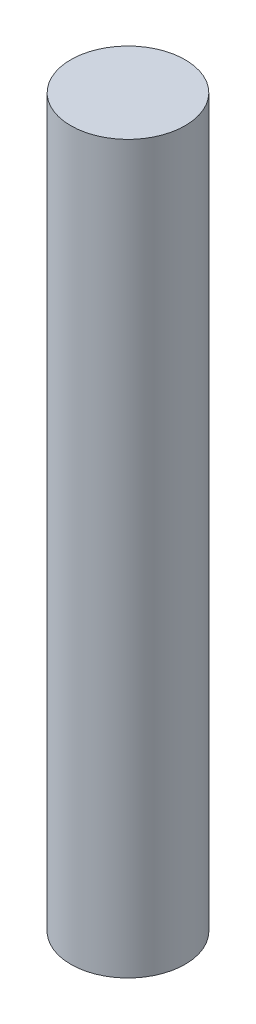
ISO-10303-21;
HEADER;
FILE_DESCRIPTION(('STEP AP214'),'2;1');
FILE_NAME('part.step','',(''),(''),'','','');
FILE_SCHEMA(('AUTOMOTIVE_DESIGN { 1 0 10303 214 1 1 1 1 }'));
ENDSEC;
DATA;
#1=APPLICATION_CONTEXT('core data for automotive mechanical design processes');
#2=APPLICATION_PROTOCOL_DEFINITION('international standard','automotive_design',2000,#1);
#3=PRODUCT_CONTEXT('',#1,'mechanical');
#4=PRODUCT('Part','Part','',(#3));
#5=PRODUCT_RELATED_PRODUCT_CATEGORY('part','',(#4));
#6=PRODUCT_DEFINITION_FORMATION('','',#4);
#7=PRODUCT_DEFINITION_CONTEXT('part definition',#1,'design');
#8=PRODUCT_DEFINITION('design','',#6,#7);
#9=PRODUCT_DEFINITION_SHAPE('','',#8);
#10=(LENGTH_UNIT() NAMED_UNIT(*) SI_UNIT(.MILLI.,.METRE.));
#11=(NAMED_UNIT(*) PLANE_ANGLE_UNIT() SI_UNIT($,.RADIAN.));
#12=(NAMED_UNIT(*) SI_UNIT($,.STERADIAN.) SOLID_ANGLE_UNIT());
#13=UNCERTAINTY_MEASURE_WITH_UNIT(LENGTH_MEASURE(1.E-05),#10,'distance_accuracy_value','');
#14=(GEOMETRIC_REPRESENTATION_CONTEXT(3) GLOBAL_UNCERTAINTY_ASSIGNED_CONTEXT((#13)) GLOBAL_UNIT_ASSIGNED_CONTEXT((#10,
#11,#12)) REPRESENTATION_CONTEXT('',''));
#15=CARTESIAN_POINT('',(0.,0.,0.));
#16=DIRECTION('',(0.,0.,1.));
#17=DIRECTION('',(1.,0.,0.));
#18=AXIS2_PLACEMENT_3D('',#15,#16,#17);
#19=CARTESIAN_POINT('',(0.,15.875,0.));
#20=DIRECTION('',(0.,-1.,0.));
#21=DIRECTION('',(0.,0.,-1.));
#22=AXIS2_PLACEMENT_3D('',#19,#20,#21);
#23=CYLINDRICAL_SURFACE('',#22,2.5);
#24=CARTESIAN_POINT('',(0.,15.875,0.));
#25=DIRECTION('',(0.,1.,0.));
#26=DIRECTION('',(0.,0.,1.));
#27=AXIS2_PLACEMENT_3D('',#24,#25,#26);
#28=CIRCLE('',#27,2.5);
#29=CARTESIAN_POINT('',(0.,15.875,2.5));
#30=VERTEX_POINT('',#29);
#31=EDGE_CURVE('E10',#30,#30,#28,.T.);
#32=ORIENTED_EDGE('',*,*,#31,.F.);
#33=EDGE_LOOP('',(#32));
#34=FACE_BOUND('',#33,.T.);
#35=CARTESIAN_POINT('',(0.,-15.875,0.));
#36=DIRECTION('',(0.,1.,0.));
#37=DIRECTION('',(0.,0.,1.));
#38=AXIS2_PLACEMENT_3D('',#35,#36,#37);
#39=CIRCLE('',#38,2.5);
#40=CARTESIAN_POINT('',(0.,-15.875,2.5));
#41=VERTEX_POINT('',#40);
#42=EDGE_CURVE('E40',#41,#41,#39,.T.);
#43=ORIENTED_EDGE('',*,*,#42,.T.);
#44=EDGE_LOOP('',(#43));
#45=FACE_BOUND('',#44,.T.);
#46=ADVANCED_FACE('F37',(#34,#45),#23,.T.);
#47=CARTESIAN_POINT('',(0.,15.875,0.));
#48=DIRECTION('',(0.,1.,0.));
#49=DIRECTION('',(0.,0.,1.));
#50=AXIS2_PLACEMENT_3D('',#47,#48,#49);
#51=PLANE('',#50);
#52=ORIENTED_EDGE('',*,*,#31,.T.);
#53=EDGE_LOOP('',(#52));
#54=FACE_BOUND('',#53,.T.);
#55=ADVANCED_FACE('F54',(#54),#51,.T.);
#56=CARTESIAN_POINT('',(0.,-15.875,0.));
#57=DIRECTION('',(0.,1.,0.));
#58=DIRECTION('',(0.,0.,1.));
#59=AXIS2_PLACEMENT_3D('',#56,#57,#58);
#60=PLANE('',#59);
#61=ORIENTED_EDGE('',*,*,#42,.F.);
#62=EDGE_LOOP('',(#61));
#63=FACE_BOUND('',#62,.T.);
#64=ADVANCED_FACE('F52',(#63),#60,.F.);
#65=CLOSED_SHELL('',(#46,#55,#64));
#66=MANIFOLD_SOLID_BREP('B2',#65);
#67=ADVANCED_BREP_SHAPE_REPRESENTATION('',(#18,#66),#14);
#68=SHAPE_DEFINITION_REPRESENTATION(#9,#67);
ENDSEC;
END-ISO-10303-21;
